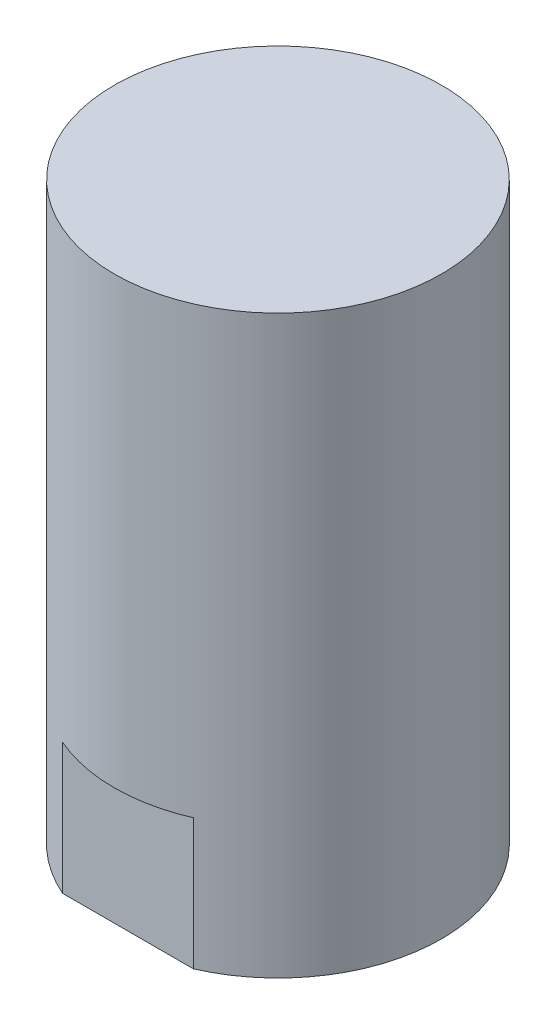
ISO-10303-21;
HEADER;
FILE_DESCRIPTION(('STEP AP214'),'2;1');
FILE_NAME('part.step','',(''),(''),'','','');
FILE_SCHEMA(('AUTOMOTIVE_DESIGN { 1 0 10303 214 1 1 1 1 }'));
ENDSEC;
DATA;
#1=APPLICATION_CONTEXT('core data for automotive mechanical design processes');
#2=APPLICATION_PROTOCOL_DEFINITION('international standard','automotive_design',2000,#1);
#3=PRODUCT_CONTEXT('',#1,'mechanical');
#4=PRODUCT('Part','Part','',(#3));
#5=PRODUCT_RELATED_PRODUCT_CATEGORY('part','',(#4));
#6=PRODUCT_DEFINITION_FORMATION('','',#4);
#7=PRODUCT_DEFINITION_CONTEXT('part definition',#1,'design');
#8=PRODUCT_DEFINITION('design','',#6,#7);
#9=PRODUCT_DEFINITION_SHAPE('','',#8);
#10=(LENGTH_UNIT() NAMED_UNIT(*) SI_UNIT(.MILLI.,.METRE.));
#11=(NAMED_UNIT(*) PLANE_ANGLE_UNIT() SI_UNIT($,.RADIAN.));
#12=(NAMED_UNIT(*) SI_UNIT($,.STERADIAN.) SOLID_ANGLE_UNIT());
#13=UNCERTAINTY_MEASURE_WITH_UNIT(LENGTH_MEASURE(1.E-05),#10,'distance_accuracy_value','');
#14=(GEOMETRIC_REPRESENTATION_CONTEXT(3) GLOBAL_UNCERTAINTY_ASSIGNED_CONTEXT((#13)) GLOBAL_UNIT_ASSIGNED_CONTEXT((#10,
#11,#12)) REPRESENTATION_CONTEXT('',''));
#15=CARTESIAN_POINT('',(0.,0.,0.));
#16=DIRECTION('',(0.,0.,1.));
#17=DIRECTION('',(1.,0.,0.));
#18=AXIS2_PLACEMENT_3D('',#15,#16,#17);
#19=CARTESIAN_POINT('',(0.,44.,0.));
#20=DIRECTION('',(0.,-1.,0.));
#21=DIRECTION('',(0.,0.,-1.));
#22=AXIS2_PLACEMENT_3D('',#19,#20,#21);
#23=CYLINDRICAL_SURFACE('',#22,12.5);
#24=CARTESIAN_POINT('',(0.,44.,0.));
#25=DIRECTION('',(0.,1.,0.));
#26=DIRECTION('',(0.,0.,1.));
#27=AXIS2_PLACEMENT_3D('',#24,#25,#26);
#28=CIRCLE('',#27,12.5);
#29=CARTESIAN_POINT('',(0.,44.,12.5));
#30=VERTEX_POINT('',#29);
#31=EDGE_CURVE('E11',#30,#30,#28,.T.);
#32=ORIENTED_EDGE('',*,*,#31,.F.);
#33=EDGE_LOOP('',(#32));
#34=FACE_BOUND('',#33,.T.);
#35=CARTESIAN_POINT('',(0.,10.,0.));
#36=DIRECTION('',(0.,-1.,0.));
#37=DIRECTION('',(0.,0.,-1.));
#38=AXIS2_PLACEMENT_3D('',#35,#36,#37);
#39=CIRCLE('',#38,12.5);
#40=CARTESIAN_POINT('',(5.,10.,11.4564392373896));
#41=VERTEX_POINT('',#40);
#42=CARTESIAN_POINT('',(-5.,10.,11.4564392373896));
#43=VERTEX_POINT('',#42);
#44=EDGE_CURVE('E71',#41,#43,#39,.T.);
#45=ORIENTED_EDGE('',*,*,#44,.F.);
#46=DIRECTION('',(0.,-1.,0.));
#47=VECTOR('',#46,1.);
#48=CARTESIAN_POINT('',(5.,10.,11.4564392373896));
#49=LINE('',#48,#47);
#50=CARTESIAN_POINT('',(5.,0.,11.4564392373896));
#51=VERTEX_POINT('',#50);
#52=EDGE_CURVE('E60',#41,#51,#49,.T.);
#53=ORIENTED_EDGE('',*,*,#52,.T.);
#54=CARTESIAN_POINT('',(0.,0.,0.));
#55=DIRECTION('',(0.,1.,0.));
#56=DIRECTION('',(0.,0.,1.));
#57=AXIS2_PLACEMENT_3D('',#54,#55,#56);
#58=CIRCLE('',#57,12.5);
#59=CARTESIAN_POINT('',(-5.,0.,11.4564392373896));
#60=VERTEX_POINT('',#59);
#61=EDGE_CURVE('E42',#51,#60,#58,.T.);
#62=ORIENTED_EDGE('',*,*,#61,.T.);
#63=DIRECTION('',(0.,-1.,0.));
#64=VECTOR('',#63,1.);
#65=CARTESIAN_POINT('',(-5.,10.,11.4564392373896));
#66=LINE('',#65,#64);
#67=EDGE_CURVE('E54',#43,#60,#66,.T.);
#68=ORIENTED_EDGE('',*,*,#67,.F.);
#69=EDGE_LOOP('',(#45,#53,#62,#68));
#70=FACE_BOUND('',#69,.T.);
#71=ADVANCED_FACE('F39',(#34,#70),#23,.T.);
#72=CARTESIAN_POINT('',(0.,44.,0.));
#73=DIRECTION('',(0.,1.,0.));
#74=DIRECTION('',(0.,0.,1.));
#75=AXIS2_PLACEMENT_3D('',#72,#73,#74);
#76=PLANE('',#75);
#77=ORIENTED_EDGE('',*,*,#31,.T.);
#78=EDGE_LOOP('',(#77));
#79=FACE_BOUND('',#78,.T.);
#80=ADVANCED_FACE('F110',(#79),#76,.T.);
#81=CARTESIAN_POINT('',(0.,0.,0.));
#82=DIRECTION('',(0.,1.,0.));
#83=DIRECTION('',(0.,0.,1.));
#84=AXIS2_PLACEMENT_3D('',#81,#82,#83);
#85=PLANE('',#84);
#86=CARTESIAN_POINT('',(0.,0.,0.));
#87=DIRECTION('',(0.,-1.,0.));
#88=DIRECTION('',(0.,0.,-1.));
#89=AXIS2_PLACEMENT_3D('',#86,#87,#88);
#90=CIRCLE('',#89,5.);
#91=CARTESIAN_POINT('',(0.,0.,-5.));
#92=VERTEX_POINT('',#91);
#93=EDGE_CURVE('E76',#92,#92,#90,.T.);
#94=ORIENTED_EDGE('',*,*,#93,.F.);
#95=EDGE_LOOP('',(#94));
#96=FACE_BOUND('',#95,.T.);
#97=ORIENTED_EDGE('',*,*,#61,.F.);
#98=DIRECTION('',(1.,0.,0.));
#99=VECTOR('',#98,1.);
#100=CARTESIAN_POINT('',(-5.,0.,11.4564392373896));
#101=LINE('',#100,#99);
#102=EDGE_CURVE('E65',#60,#51,#101,.T.);
#103=ORIENTED_EDGE('',*,*,#102,.F.);
#104=EDGE_LOOP('',(#97,#103));
#105=FACE_BOUND('',#104,.T.);
#106=ADVANCED_FACE('F78',(#96,#105),#85,.F.);
#107=CARTESIAN_POINT('',(-5.,10.,11.4564392373896));
#108=DIRECTION('',(0.,0.,-1.));
#109=DIRECTION('',(-1.,0.,0.));
#110=AXIS2_PLACEMENT_3D('',#107,#108,#109);
#111=PLANE('',#110);
#112=ORIENTED_EDGE('',*,*,#102,.T.);
#113=ORIENTED_EDGE('',*,*,#52,.F.);
#114=DIRECTION('',(1.,0.,0.));
#115=VECTOR('',#114,1.);
#116=CARTESIAN_POINT('',(-5.,10.,11.4564392373896));
#117=LINE('',#116,#115);
#118=EDGE_CURVE('E92',#43,#41,#117,.T.);
#119=ORIENTED_EDGE('',*,*,#118,.F.);
#120=ORIENTED_EDGE('',*,*,#67,.T.);
#121=EDGE_LOOP('',(#112,#113,#119,#120));
#122=FACE_BOUND('',#121,.T.);
#123=ADVANCED_FACE('F66',(#122),#111,.F.);
#124=CARTESIAN_POINT('',(0.,10.,0.));
#125=DIRECTION('',(0.,-1.,0.));
#126=DIRECTION('',(0.,0.,-1.));
#127=AXIS2_PLACEMENT_3D('',#124,#125,#126);
#128=PLANE('',#127);
#129=ORIENTED_EDGE('',*,*,#44,.T.);
#130=ORIENTED_EDGE('',*,*,#118,.T.);
#131=EDGE_LOOP('',(#129,#130));
#132=FACE_BOUND('',#131,.T.);
#133=ADVANCED_FACE('F97',(#132),#128,.T.);
#134=CARTESIAN_POINT('',(0.,10.,0.));
#135=DIRECTION('',(0.,-1.,0.));
#136=DIRECTION('',(0.,0.,-1.));
#137=AXIS2_PLACEMENT_3D('',#134,#135,#136);
#138=CYLINDRICAL_SURFACE('',#137,5.);
#139=CARTESIAN_POINT('',(0.,10.,0.));
#140=DIRECTION('',(0.,-1.,0.));
#141=DIRECTION('',(0.,0.,-1.));
#142=AXIS2_PLACEMENT_3D('',#139,#140,#141);
#143=CIRCLE('',#142,5.);
#144=CARTESIAN_POINT('',(0.,10.,-5.));
#145=VERTEX_POINT('',#144);
#146=EDGE_CURVE('E80',#145,#145,#143,.T.);
#147=ORIENTED_EDGE('',*,*,#146,.F.);
#148=EDGE_LOOP('',(#147));
#149=FACE_BOUND('',#148,.T.);
#150=ORIENTED_EDGE('',*,*,#93,.T.);
#151=EDGE_LOOP('',(#150));
#152=FACE_BOUND('',#151,.T.);
#153=ADVANCED_FACE('F99',(#149,#152),#138,.F.);
#154=CARTESIAN_POINT('',(0.,10.,0.));
#155=DIRECTION('',(0.,-1.,0.));
#156=DIRECTION('',(0.,0.,-1.));
#157=AXIS2_PLACEMENT_3D('',#154,#155,#156);
#158=PLANE('',#157);
#159=ORIENTED_EDGE('',*,*,#146,.T.);
#160=EDGE_LOOP('',(#159));
#161=FACE_BOUND('',#160,.T.);
#162=ADVANCED_FACE('F105',(#161),#158,.T.);
#163=CLOSED_SHELL('',(#71,#80,#106,#123,#133,#153,#162));
#164=MANIFOLD_SOLID_BREP('B2',#163);
#165=ADVANCED_BREP_SHAPE_REPRESENTATION('',(#18,#164),#14);
#166=SHAPE_DEFINITION_REPRESENTATION(#9,#165);
ENDSEC;
END-ISO-10303-21;
